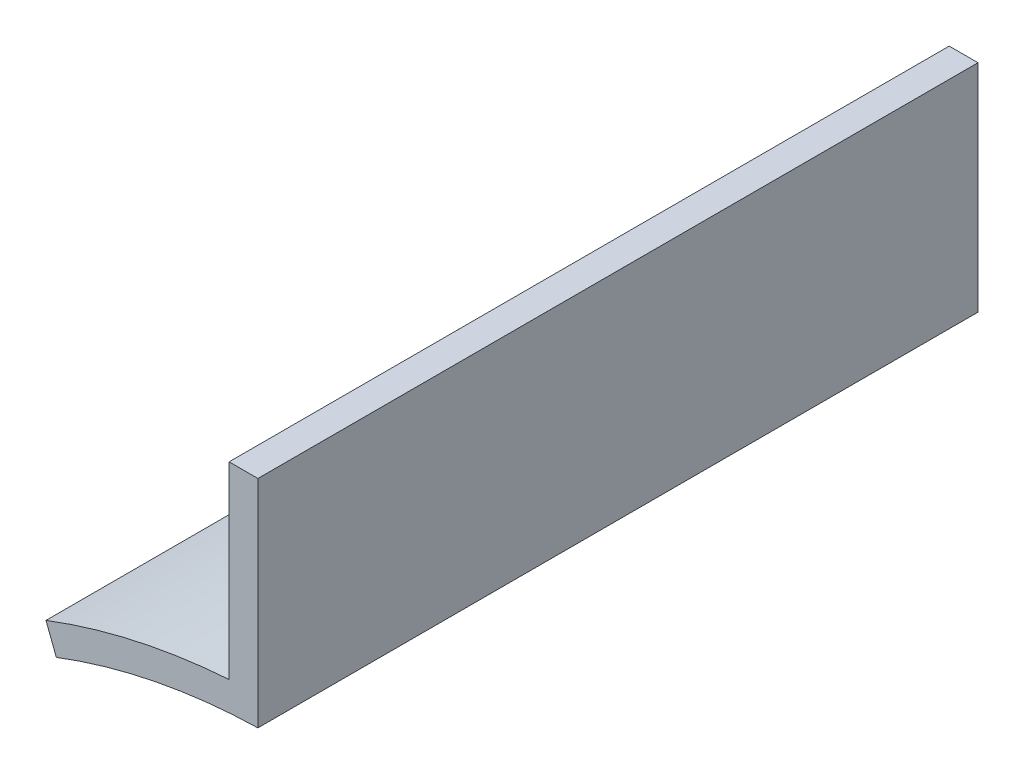
ISO-10303-21;
HEADER;
FILE_DESCRIPTION(('STEP AP214'),'2;1');
FILE_NAME('part.step','',(''),(''),'','','');
FILE_SCHEMA(('AUTOMOTIVE_DESIGN { 1 0 10303 214 1 1 1 1 }'));
ENDSEC;
DATA;
#1=APPLICATION_CONTEXT('core data for automotive mechanical design processes');
#2=APPLICATION_PROTOCOL_DEFINITION('international standard','automotive_design',2000,#1);
#3=PRODUCT_CONTEXT('',#1,'mechanical');
#4=PRODUCT('Part','Part','',(#3));
#5=PRODUCT_RELATED_PRODUCT_CATEGORY('part','',(#4));
#6=PRODUCT_DEFINITION_FORMATION('','',#4);
#7=PRODUCT_DEFINITION_CONTEXT('part definition',#1,'design');
#8=PRODUCT_DEFINITION('design','',#6,#7);
#9=PRODUCT_DEFINITION_SHAPE('','',#8);
#10=(LENGTH_UNIT() NAMED_UNIT(*) SI_UNIT(.MILLI.,.METRE.));
#11=(NAMED_UNIT(*) PLANE_ANGLE_UNIT() SI_UNIT($,.RADIAN.));
#12=(NAMED_UNIT(*) SI_UNIT($,.STERADIAN.) SOLID_ANGLE_UNIT());
#13=UNCERTAINTY_MEASURE_WITH_UNIT(LENGTH_MEASURE(1.E-05),#10,'distance_accuracy_value','');
#14=(GEOMETRIC_REPRESENTATION_CONTEXT(3) GLOBAL_UNCERTAINTY_ASSIGNED_CONTEXT((#13)) GLOBAL_UNIT_ASSIGNED_CONTEXT((#10,
#11,#12)) REPRESENTATION_CONTEXT('',''));
#15=CARTESIAN_POINT('',(0.,0.,0.));
#16=DIRECTION('',(0.,0.,1.));
#17=DIRECTION('',(1.,0.,0.));
#18=AXIS2_PLACEMENT_3D('',#15,#16,#17);
#19=CARTESIAN_POINT('',(0.,0.,50.));
#20=DIRECTION('',(0.,0.,-1.));
#21=DIRECTION('',(-1.,0.,0.));
#22=AXIS2_PLACEMENT_3D('',#19,#20,#21);
#23=CYLINDRICAL_SURFACE('',#22,42.);
#24=CARTESIAN_POINT('',(0.,0.,0.));
#25=DIRECTION('',(0.,0.,-1.));
#26=DIRECTION('',(-1.,0.,0.));
#27=AXIS2_PLACEMENT_3D('',#24,#25,#26);
#28=CIRCLE('',#27,42.);
#29=CARTESIAN_POINT('',(-15.,39.2300904918661,0.));
#30=VERTEX_POINT('',#29);
#31=CARTESIAN_POINT('',(-1.,41.988093550434,0.));
#32=VERTEX_POINT('',#31);
#33=EDGE_CURVE('E118',#30,#32,#28,.T.);
#34=ORIENTED_EDGE('',*,*,#33,.T.);
#35=DIRECTION('',(0.,0.,-1.));
#36=VECTOR('',#35,1.);
#37=CARTESIAN_POINT('',(-1.,41.988093550434,50.));
#38=LINE('',#37,#36);
#39=CARTESIAN_POINT('',(-1.,41.988093550434,50.));
#40=VERTEX_POINT('',#39);
#41=EDGE_CURVE('E11',#40,#32,#38,.T.);
#42=ORIENTED_EDGE('',*,*,#41,.F.);
#43=CARTESIAN_POINT('',(0.,0.,50.));
#44=DIRECTION('',(0.,0.,-1.));
#45=DIRECTION('',(-1.,0.,0.));
#46=AXIS2_PLACEMENT_3D('',#43,#44,#45);
#47=CIRCLE('',#46,42.);
#48=CARTESIAN_POINT('',(-15.,39.2300904918661,50.));
#49=VERTEX_POINT('',#48);
#50=EDGE_CURVE('E128',#49,#40,#47,.T.);
#51=ORIENTED_EDGE('',*,*,#50,.F.);
#52=DIRECTION('',(0.,0.,-1.));
#53=VECTOR('',#52,1.);
#54=CARTESIAN_POINT('',(-15.,39.2300904918661,50.));
#55=LINE('',#54,#53);
#56=EDGE_CURVE('E114',#49,#30,#55,.T.);
#57=ORIENTED_EDGE('',*,*,#56,.T.);
#58=EDGE_LOOP('',(#34,#42,#51,#57));
#59=FACE_BOUND('',#58,.T.);
#60=ADVANCED_FACE('F34',(#59),#23,.F.);
#61=CARTESIAN_POINT('',(-1.,41.988093550434,50.));
#62=DIRECTION('',(-1.,0.,0.));
#63=DIRECTION('',(0.,0.,1.));
#64=AXIS2_PLACEMENT_3D('',#61,#62,#63);
#65=PLANE('',#64);
#66=DIRECTION('',(0.,1.,0.));
#67=VECTOR('',#66,1.);
#68=CARTESIAN_POINT('',(-1.,41.988093550434,0.));
#69=LINE('',#68,#67);
#70=CARTESIAN_POINT('',(-1.,56.988093550434,0.));
#71=VERTEX_POINT('',#70);
#72=EDGE_CURVE('E121',#32,#71,#69,.T.);
#73=ORIENTED_EDGE('',*,*,#72,.T.);
#74=DIRECTION('',(0.,0.,-1.));
#75=VECTOR('',#74,1.);
#76=CARTESIAN_POINT('',(-1.,56.988093550434,50.));
#77=LINE('',#76,#75);
#78=CARTESIAN_POINT('',(-1.,56.988093550434,50.));
#79=VERTEX_POINT('',#78);
#80=EDGE_CURVE('E42',#79,#71,#77,.T.);
#81=ORIENTED_EDGE('',*,*,#80,.F.);
#82=DIRECTION('',(0.,1.,0.));
#83=VECTOR('',#82,1.);
#84=CARTESIAN_POINT('',(-1.,41.988093550434,50.));
#85=LINE('',#84,#83);
#86=EDGE_CURVE('E87',#40,#79,#85,.T.);
#87=ORIENTED_EDGE('',*,*,#86,.F.);
#88=ORIENTED_EDGE('',*,*,#41,.T.);
#89=EDGE_LOOP('',(#73,#81,#87,#88));
#90=FACE_BOUND('',#89,.T.);
#91=ADVANCED_FACE('F152',(#90),#65,.F.);
#92=CARTESIAN_POINT('',(-3.,56.988093550434,50.));
#93=DIRECTION('',(0.,-1.,0.));
#94=DIRECTION('',(0.,0.,-1.));
#95=AXIS2_PLACEMENT_3D('',#92,#93,#94);
#96=PLANE('',#95);
#97=DIRECTION('',(-1.,0.,0.));
#98=VECTOR('',#97,1.);
#99=CARTESIAN_POINT('',(-3.,56.988093550434,0.));
#100=LINE('',#99,#98);
#101=CARTESIAN_POINT('',(-3.,56.988093550434,0.));
#102=VERTEX_POINT('',#101);
#103=EDGE_CURVE('E123',#71,#102,#100,.T.);
#104=ORIENTED_EDGE('',*,*,#103,.T.);
#105=DIRECTION('',(0.,0.,-1.));
#106=VECTOR('',#105,1.);
#107=CARTESIAN_POINT('',(-3.,56.988093550434,50.));
#108=LINE('',#107,#106);
#109=CARTESIAN_POINT('',(-3.,56.988093550434,50.));
#110=VERTEX_POINT('',#109);
#111=EDGE_CURVE('E109',#110,#102,#108,.T.);
#112=ORIENTED_EDGE('',*,*,#111,.F.);
#113=DIRECTION('',(-1.,0.,0.));
#114=VECTOR('',#113,1.);
#115=CARTESIAN_POINT('',(-3.,56.988093550434,50.));
#116=LINE('',#115,#114);
#117=EDGE_CURVE('E100',#79,#110,#116,.T.);
#118=ORIENTED_EDGE('',*,*,#117,.F.);
#119=ORIENTED_EDGE('',*,*,#80,.T.);
#120=EDGE_LOOP('',(#104,#112,#118,#119));
#121=FACE_BOUND('',#120,.T.);
#122=ADVANCED_FACE('F134',(#121),#96,.F.);
#123=CARTESIAN_POINT('',(-3.,43.8976081352959,50.));
#124=DIRECTION('',(1.,0.,0.));
#125=DIRECTION('',(0.,0.,-1.));
#126=AXIS2_PLACEMENT_3D('',#123,#124,#125);
#127=PLANE('',#126);
#128=DIRECTION('',(0.,-1.,0.));
#129=VECTOR('',#128,1.);
#130=CARTESIAN_POINT('',(-3.,43.8976081352959,0.));
#131=LINE('',#130,#129);
#132=CARTESIAN_POINT('',(-3.,43.8976081352959,0.));
#133=VERTEX_POINT('',#132);
#134=EDGE_CURVE('E108',#102,#133,#131,.T.);
#135=ORIENTED_EDGE('',*,*,#134,.T.);
#136=DIRECTION('',(0.,0.,-1.));
#137=VECTOR('',#136,1.);
#138=CARTESIAN_POINT('',(-3.,43.8976081352959,50.));
#139=LINE('',#138,#137);
#140=CARTESIAN_POINT('',(-3.,43.8976081352959,50.));
#141=VERTEX_POINT('',#140);
#142=EDGE_CURVE('E105',#141,#133,#139,.T.);
#143=ORIENTED_EDGE('',*,*,#142,.F.);
#144=DIRECTION('',(0.,-1.,0.));
#145=VECTOR('',#144,1.);
#146=CARTESIAN_POINT('',(-3.,43.8976081352959,50.));
#147=LINE('',#146,#145);
#148=EDGE_CURVE('E94',#110,#141,#147,.T.);
#149=ORIENTED_EDGE('',*,*,#148,.F.);
#150=ORIENTED_EDGE('',*,*,#111,.T.);
#151=EDGE_LOOP('',(#135,#143,#149,#150));
#152=FACE_BOUND('',#151,.T.);
#153=ADVANCED_FACE('F106',(#152),#127,.F.);
#154=CARTESIAN_POINT('',(0.,0.,50.));
#155=DIRECTION('',(0.,0.,-1.));
#156=DIRECTION('',(-1.,0.,0.));
#157=AXIS2_PLACEMENT_3D('',#154,#155,#156);
#158=CYLINDRICAL_SURFACE('',#157,44.);
#159=CARTESIAN_POINT('',(0.,0.,0.));
#160=DIRECTION('',(0.,0.,1.));
#161=DIRECTION('',(-1.,0.,0.));
#162=AXIS2_PLACEMENT_3D('',#159,#160,#161);
#163=CIRCLE('',#162,44.);
#164=CARTESIAN_POINT('',(-15.7142857142857,41.0981900390978,0.));
#165=VERTEX_POINT('',#164);
#166=EDGE_CURVE('E73',#133,#165,#163,.T.);
#167=ORIENTED_EDGE('',*,*,#166,.T.);
#168=DIRECTION('',(0.,0.,-1.));
#169=VECTOR('',#168,1.);
#170=CARTESIAN_POINT('',(-15.7142857142857,41.0981900390978,50.));
#171=LINE('',#170,#169);
#172=CARTESIAN_POINT('',(-15.7142857142857,41.0981900390978,50.));
#173=VERTEX_POINT('',#172);
#174=EDGE_CURVE('E110',#173,#165,#171,.T.);
#175=ORIENTED_EDGE('',*,*,#174,.F.);
#176=CARTESIAN_POINT('',(0.,0.,50.));
#177=DIRECTION('',(0.,0.,1.));
#178=DIRECTION('',(-1.,0.,0.));
#179=AXIS2_PLACEMENT_3D('',#176,#177,#178);
#180=CIRCLE('',#179,44.);
#181=EDGE_CURVE('E98',#141,#173,#180,.T.);
#182=ORIENTED_EDGE('',*,*,#181,.F.);
#183=ORIENTED_EDGE('',*,*,#142,.T.);
#184=EDGE_LOOP('',(#167,#175,#182,#183));
#185=FACE_BOUND('',#184,.T.);
#186=ADVANCED_FACE('F112',(#185),#158,.T.);
#187=CARTESIAN_POINT('',(-15.7142857142857,41.0981900390978,50.));
#188=DIRECTION('',(0.934049773615858,0.357142857142858,0.));
#189=DIRECTION('',(-0.357142857142858,0.934049773615858,0.));
#190=AXIS2_PLACEMENT_3D('',#187,#188,#189);
#191=PLANE('',#190);
#192=DIRECTION('',(0.357142857142858,-0.934049773615858,0.));
#193=VECTOR('',#192,1.);
#194=CARTESIAN_POINT('',(-15.7142857142857,41.0981900390978,0.));
#195=LINE('',#194,#193);
#196=EDGE_CURVE('E79',#165,#30,#195,.T.);
#197=ORIENTED_EDGE('',*,*,#196,.T.);
#198=ORIENTED_EDGE('',*,*,#56,.F.);
#199=DIRECTION('',(0.357142857142858,-0.934049773615858,0.));
#200=VECTOR('',#199,1.);
#201=CARTESIAN_POINT('',(-15.7142857142857,41.0981900390978,50.));
#202=LINE('',#201,#200);
#203=EDGE_CURVE('E50',#173,#49,#202,.T.);
#204=ORIENTED_EDGE('',*,*,#203,.F.);
#205=ORIENTED_EDGE('',*,*,#174,.T.);
#206=EDGE_LOOP('',(#197,#198,#204,#205));
#207=FACE_BOUND('',#206,.T.);
#208=ADVANCED_FACE('F141',(#207),#191,.F.);
#209=CARTESIAN_POINT('',(0.,0.,50.));
#210=DIRECTION('',(0.,0.,-1.));
#211=DIRECTION('',(-1.,0.,0.));
#212=AXIS2_PLACEMENT_3D('',#209,#210,#211);
#213=PLANE('',#212);
#214=ORIENTED_EDGE('',*,*,#50,.T.);
#215=ORIENTED_EDGE('',*,*,#86,.T.);
#216=ORIENTED_EDGE('',*,*,#117,.T.);
#217=ORIENTED_EDGE('',*,*,#148,.T.);
#218=ORIENTED_EDGE('',*,*,#181,.T.);
#219=ORIENTED_EDGE('',*,*,#203,.T.);
#220=EDGE_LOOP('',(#214,#215,#216,#217,#218,#219));
#221=FACE_BOUND('',#220,.T.);
#222=ADVANCED_FACE('F96',(#221),#213,.F.);
#223=CARTESIAN_POINT('',(0.,0.,0.));
#224=DIRECTION('',(0.,0.,-1.));
#225=DIRECTION('',(-1.,0.,0.));
#226=AXIS2_PLACEMENT_3D('',#223,#224,#225);
#227=PLANE('',#226);
#228=ORIENTED_EDGE('',*,*,#33,.F.);
#229=ORIENTED_EDGE('',*,*,#196,.F.);
#230=ORIENTED_EDGE('',*,*,#166,.F.);
#231=ORIENTED_EDGE('',*,*,#134,.F.);
#232=ORIENTED_EDGE('',*,*,#103,.F.);
#233=ORIENTED_EDGE('',*,*,#72,.F.);
#234=EDGE_LOOP('',(#228,#229,#230,#231,#232,#233));
#235=FACE_BOUND('',#234,.T.);
#236=ADVANCED_FACE('F137',(#235),#227,.T.);
#237=CLOSED_SHELL('',(#60,#91,#122,#153,#186,#208,#222,#236));
#238=MANIFOLD_SOLID_BREP('B2',#237);
#239=ADVANCED_BREP_SHAPE_REPRESENTATION('',(#18,#238),#14);
#240=SHAPE_DEFINITION_REPRESENTATION(#9,#239);
ENDSEC;
END-ISO-10303-21;
